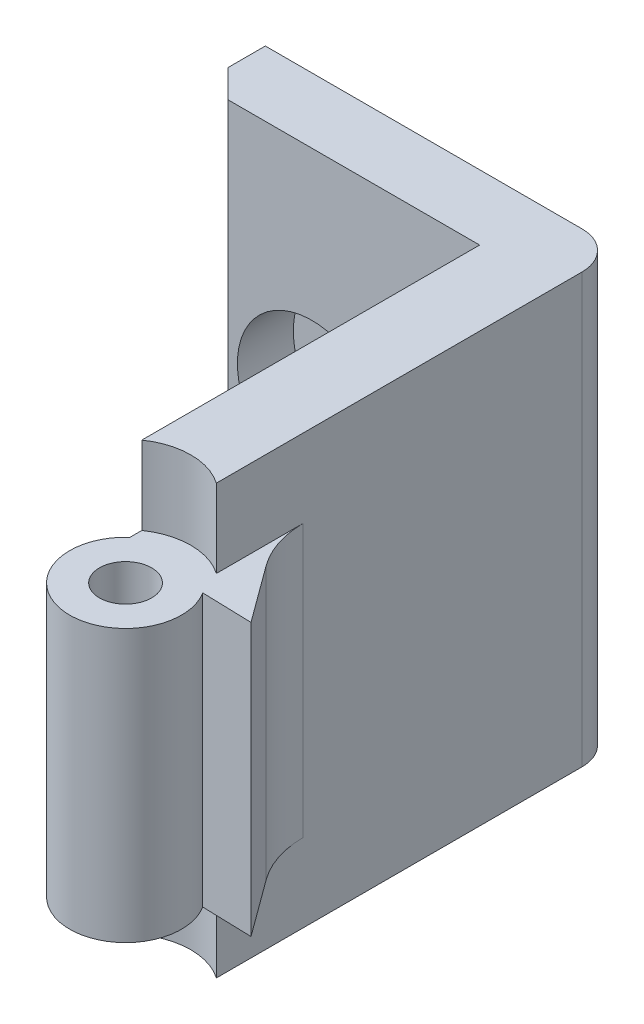
ISO-10303-21;
HEADER;
FILE_DESCRIPTION(('STEP AP214'),'2;1');
FILE_NAME('part.step','',(''),(''),'','','');
FILE_SCHEMA(('AUTOMOTIVE_DESIGN { 1 0 10303 214 1 1 1 1 }'));
ENDSEC;
DATA;
#1=APPLICATION_CONTEXT('core data for automotive mechanical design processes');
#2=APPLICATION_PROTOCOL_DEFINITION('international standard','automotive_design',2000,#1);
#3=PRODUCT_CONTEXT('',#1,'mechanical');
#4=PRODUCT('Part','Part','',(#3));
#5=PRODUCT_RELATED_PRODUCT_CATEGORY('part','',(#4));
#6=PRODUCT_DEFINITION_FORMATION('','',#4);
#7=PRODUCT_DEFINITION_CONTEXT('part definition',#1,'design');
#8=PRODUCT_DEFINITION('design','',#6,#7);
#9=PRODUCT_DEFINITION_SHAPE('','',#8);
#10=(LENGTH_UNIT() NAMED_UNIT(*) SI_UNIT(.MILLI.,.METRE.));
#11=(NAMED_UNIT(*) PLANE_ANGLE_UNIT() SI_UNIT($,.RADIAN.));
#12=(NAMED_UNIT(*) SI_UNIT($,.STERADIAN.) SOLID_ANGLE_UNIT());
#13=UNCERTAINTY_MEASURE_WITH_UNIT(LENGTH_MEASURE(1.E-05),#10,'distance_accuracy_value','');
#14=(GEOMETRIC_REPRESENTATION_CONTEXT(3) GLOBAL_UNCERTAINTY_ASSIGNED_CONTEXT((#13)) GLOBAL_UNIT_ASSIGNED_CONTEXT((#10,
#11,#12)) REPRESENTATION_CONTEXT('',''));
#15=CARTESIAN_POINT('',(0.,0.,0.));
#16=DIRECTION('',(0.,0.,1.));
#17=DIRECTION('',(1.,0.,0.));
#18=AXIS2_PLACEMENT_3D('',#15,#16,#17);
#19=CARTESIAN_POINT('',(-2.71323529411764,31.4852813742386,9.26470588235293));
#20=DIRECTION('',(0.,-1.,0.));
#21=DIRECTION('',(0.,0.,-1.));
#22=AXIS2_PLACEMENT_3D('',#19,#20,#21);
#23=CYLINDRICAL_SURFACE('',#22,3.);
#24=DIRECTION('',(0.,-1.,0.));
#25=VECTOR('',#24,1.);
#26=CARTESIAN_POINT('',(-0.179103081379327,31.4852813742386,7.65903657382081));
#27=LINE('',#26,#25);
#28=CARTESIAN_POINT('',(-0.179103081379326,18.8,7.65903657382081));
#29=VERTEX_POINT('',#28);
#30=CARTESIAN_POINT('',(-0.179103081379326,4.2,7.65903657382081));
#31=VERTEX_POINT('',#30);
#32=EDGE_CURVE('E150',#29,#31,#27,.T.);
#33=ORIENTED_EDGE('',*,*,#32,.F.);
#34=CARTESIAN_POINT('',(-2.71323529411764,18.8,9.26470588235293));
#35=DIRECTION('',(0.,1.,0.));
#36=DIRECTION('',(0.,0.,1.));
#37=AXIS2_PLACEMENT_3D('',#34,#35,#36);
#38=CIRCLE('',#37,3.);
#39=CARTESIAN_POINT('',(-4.71323529411765,18.8,7.02863790485314));
#40=VERTEX_POINT('',#39);
#41=EDGE_CURVE('E185',#29,#40,#38,.F.);
#42=ORIENTED_EDGE('',*,*,#41,.T.);
#43=DIRECTION('',(0.,-1.,0.));
#44=VECTOR('',#43,1.);
#45=CARTESIAN_POINT('',(-4.71323529411765,31.4852813742386,7.02863790485314));
#46=LINE('',#45,#44);
#47=CARTESIAN_POINT('',(-4.71323529411765,4.2,7.02863790485314));
#48=VERTEX_POINT('',#47);
#49=EDGE_CURVE('E209',#48,#40,#46,.F.);
#50=ORIENTED_EDGE('',*,*,#49,.F.);
#51=CARTESIAN_POINT('',(-2.71323529411764,4.2,9.26470588235293));
#52=DIRECTION('',(0.,-1.,0.));
#53=DIRECTION('',(0.,0.,-1.));
#54=AXIS2_PLACEMENT_3D('',#51,#52,#53);
#55=CIRCLE('',#54,3.);
#56=EDGE_CURVE('E199',#48,#31,#55,.F.);
#57=ORIENTED_EDGE('',*,*,#56,.T.);
#58=EDGE_LOOP('',(#33,#42,#50,#57));
#59=FACE_BOUND('',#58,.T.);
#60=ADVANCED_FACE('F35',(#59),#23,.T.);
#61=CARTESIAN_POINT('',(-2.71323529411764,23.,9.26470588235293));
#62=DIRECTION('',(0.,-1.,0.));
#63=DIRECTION('',(0.,0.,-1.));
#64=AXIS2_PLACEMENT_3D('',#61,#62,#63);
#65=CYLINDRICAL_SURFACE('',#64,1.4);
#66=CARTESIAN_POINT('',(-2.71323529411764,4.2,9.26470588235293));
#67=DIRECTION('',(0.,-1.,0.));
#68=DIRECTION('',(0.,0.,-1.));
#69=AXIS2_PLACEMENT_3D('',#66,#67,#68);
#70=CIRCLE('',#69,1.4);
#71=CARTESIAN_POINT('',(-2.71323529411764,4.2,7.86470588235293));
#72=VERTEX_POINT('',#71);
#73=EDGE_CURVE('E196',#72,#72,#70,.F.);
#74=ORIENTED_EDGE('',*,*,#73,.F.);
#75=EDGE_LOOP('',(#74));
#76=FACE_BOUND('',#75,.T.);
#77=CARTESIAN_POINT('',(-2.71323529411764,18.8,9.26470588235293));
#78=DIRECTION('',(0.,1.,0.));
#79=DIRECTION('',(0.,0.,1.));
#80=AXIS2_PLACEMENT_3D('',#77,#78,#79);
#81=CIRCLE('',#80,1.4);
#82=CARTESIAN_POINT('',(-2.71323529411764,18.8,10.6647058823529));
#83=VERTEX_POINT('',#82);
#84=EDGE_CURVE('E190',#83,#83,#81,.F.);
#85=ORIENTED_EDGE('',*,*,#84,.F.);
#86=EDGE_LOOP('',(#85));
#87=FACE_BOUND('',#86,.T.);
#88=ADVANCED_FACE('F323',(#76,#87),#65,.F.);
#89=CARTESIAN_POINT('',(0.,23.,-11.7352941176471));
#90=DIRECTION('',(0.,0.,-1.));
#91=DIRECTION('',(-1.,0.,0.));
#92=AXIS2_PLACEMENT_3D('',#89,#90,#91);
#93=PLANE('',#92);
#94=CARTESIAN_POINT('',(-13.7132352941176,11.,-11.7352941176471));
#95=DIRECTION('',(0.,0.,1.));
#96=DIRECTION('',(1.,0.,0.));
#97=AXIS2_PLACEMENT_3D('',#94,#95,#96);
#98=CIRCLE('',#97,4.);
#99=CARTESIAN_POINT('',(-9.71323529411764,11.,-11.7352941176471));
#100=VERTEX_POINT('',#99);
#101=EDGE_CURVE('E169',#100,#100,#98,.T.);
#102=ORIENTED_EDGE('',*,*,#101,.F.);
#103=EDGE_LOOP('',(#102));
#104=FACE_BOUND('',#103,.T.);
#105=DIRECTION('',(1.,0.,0.));
#106=VECTOR('',#105,1.);
#107=CARTESIAN_POINT('',(0.,23.,-11.7352941176471));
#108=LINE('',#107,#106);
#109=CARTESIAN_POINT('',(-18.2132352941176,23.,-11.7352941176471));
#110=VERTEX_POINT('',#109);
#111=CARTESIAN_POINT('',(-4.71323529411765,23.,-11.7352941176471));
#112=VERTEX_POINT('',#111);
#113=EDGE_CURVE('E213',#110,#112,#108,.T.);
#114=ORIENTED_EDGE('',*,*,#113,.F.);
#115=DIRECTION('',(0.,-1.,0.));
#116=VECTOR('',#115,1.);
#117=CARTESIAN_POINT('',(-18.2132352941176,23.,-11.7352941176471));
#118=LINE('',#117,#116);
#119=CARTESIAN_POINT('',(-18.2132352941176,0.,-11.7352941176471));
#120=VERTEX_POINT('',#119);
#121=EDGE_CURVE('E243',#110,#120,#118,.T.);
#122=ORIENTED_EDGE('',*,*,#121,.T.);
#123=DIRECTION('',(1.,0.,0.));
#124=VECTOR('',#123,1.);
#125=CARTESIAN_POINT('',(0.,0.,-11.7352941176471));
#126=LINE('',#125,#124);
#127=CARTESIAN_POINT('',(-4.71323529411765,0.,-11.7352941176471));
#128=VERTEX_POINT('',#127);
#129=EDGE_CURVE('E212',#120,#128,#126,.T.);
#130=ORIENTED_EDGE('',*,*,#129,.T.);
#131=DIRECTION('',(0.,-1.,0.));
#132=VECTOR('',#131,1.);
#133=CARTESIAN_POINT('',(-4.71323529411765,23.,-11.7352941176471));
#134=LINE('',#133,#132);
#135=EDGE_CURVE('E240',#112,#128,#134,.T.);
#136=ORIENTED_EDGE('',*,*,#135,.F.);
#137=EDGE_LOOP('',(#114,#122,#130,#136));
#138=FACE_BOUND('',#137,.T.);
#139=ADVANCED_FACE('F291',(#104,#138),#93,.F.);
#140=CARTESIAN_POINT('',(-4.71323529411765,23.,0.));
#141=DIRECTION('',(1.,0.,0.));
#142=DIRECTION('',(0.,0.,-1.));
#143=AXIS2_PLACEMENT_3D('',#140,#141,#142);
#144=PLANE('',#143);
#145=DIRECTION('',(0.,0.,1.));
#146=VECTOR('',#145,1.);
#147=CARTESIAN_POINT('',(-4.71323529411765,18.8,0.));
#148=LINE('',#147,#146);
#149=CARTESIAN_POINT('',(-4.71323529411765,18.8,6.39242455908392));
#150=VERTEX_POINT('',#149);
#151=EDGE_CURVE('E187',#150,#40,#148,.T.);
#152=ORIENTED_EDGE('',*,*,#151,.F.);
#153=DIRECTION('',(0.,1.,0.));
#154=VECTOR('',#153,1.);
#155=CARTESIAN_POINT('',(-4.71323529411765,18.8,6.39242455908392));
#156=LINE('',#155,#154);
#157=CARTESIAN_POINT('',(-4.71323529411765,23.,6.39242455908392));
#158=VERTEX_POINT('',#157);
#159=EDGE_CURVE('E182',#150,#158,#156,.T.);
#160=ORIENTED_EDGE('',*,*,#159,.T.);
#161=DIRECTION('',(0.,0.,1.));
#162=VECTOR('',#161,1.);
#163=CARTESIAN_POINT('',(-4.71323529411765,23.,0.));
#164=LINE('',#163,#162);
#165=EDGE_CURVE('E215',#112,#158,#164,.T.);
#166=ORIENTED_EDGE('',*,*,#165,.F.);
#167=ORIENTED_EDGE('',*,*,#135,.T.);
#168=DIRECTION('',(0.,0.,1.));
#169=VECTOR('',#168,1.);
#170=CARTESIAN_POINT('',(-4.71323529411765,0.,0.));
#171=LINE('',#170,#169);
#172=CARTESIAN_POINT('',(-4.71323529411765,0.,6.39242455908392));
#173=VERTEX_POINT('',#172);
#174=EDGE_CURVE('E229',#128,#173,#171,.T.);
#175=ORIENTED_EDGE('',*,*,#174,.T.);
#176=DIRECTION('',(0.,-1.,0.));
#177=VECTOR('',#176,1.);
#178=CARTESIAN_POINT('',(-4.71323529411765,4.2,6.39242455908392));
#179=LINE('',#178,#177);
#180=CARTESIAN_POINT('',(-4.71323529411765,4.2,6.39242455908392));
#181=VERTEX_POINT('',#180);
#182=EDGE_CURVE('E206',#173,#181,#179,.F.);
#183=ORIENTED_EDGE('',*,*,#182,.T.);
#184=DIRECTION('',(0.,0.,-1.));
#185=VECTOR('',#184,1.);
#186=CARTESIAN_POINT('',(-4.71323529411765,4.2,0.));
#187=LINE('',#186,#185);
#188=EDGE_CURVE('E201',#48,#181,#187,.T.);
#189=ORIENTED_EDGE('',*,*,#188,.F.);
#190=ORIENTED_EDGE('',*,*,#49,.T.);
#191=EDGE_LOOP('',(#152,#160,#166,#167,#175,#183,#189,#190));
#192=FACE_BOUND('',#191,.T.);
#193=ADVANCED_FACE('F285',(#192),#144,.F.);
#194=CARTESIAN_POINT('',(-0.713235294117643,23.,0.));
#195=DIRECTION('',(1.,0.,0.));
#196=DIRECTION('',(0.,0.,-1.));
#197=AXIS2_PLACEMENT_3D('',#194,#195,#196);
#198=PLANE('',#197);
#199=DIRECTION('',(0.,0.,1.));
#200=VECTOR('',#199,1.);
#201=CARTESIAN_POINT('',(-0.713235294117643,18.8,0.));
#202=LINE('',#201,#200);
#203=CARTESIAN_POINT('',(-0.713235294117642,18.8,1.73031096763127));
#204=VERTEX_POINT('',#203);
#205=CARTESIAN_POINT('',(-0.713235294117641,18.8,6.39242455908392));
#206=VERTEX_POINT('',#205);
#207=EDGE_CURVE('E50',#204,#206,#202,.T.);
#208=ORIENTED_EDGE('',*,*,#207,.F.);
#209=DIRECTION('',(0.,1.,0.));
#210=VECTOR('',#209,1.);
#211=CARTESIAN_POINT('',(-0.713235294117642,4.2,1.73031096763127));
#212=LINE('',#211,#210);
#213=CARTESIAN_POINT('',(-0.713235294117642,4.2,1.73031096763127));
#214=VERTEX_POINT('',#213);
#215=EDGE_CURVE('E265',#204,#214,#212,.F.);
#216=ORIENTED_EDGE('',*,*,#215,.T.);
#217=DIRECTION('',(0.,0.,-1.));
#218=VECTOR('',#217,1.);
#219=CARTESIAN_POINT('',(-0.713235294117643,4.2,0.));
#220=LINE('',#219,#218);
#221=CARTESIAN_POINT('',(-0.713235294117641,4.2,6.39242455908392));
#222=VERTEX_POINT('',#221);
#223=EDGE_CURVE('E57',#222,#214,#220,.T.);
#224=ORIENTED_EDGE('',*,*,#223,.F.);
#225=DIRECTION('',(0.,-1.,0.));
#226=VECTOR('',#225,1.);
#227=CARTESIAN_POINT('',(-0.713235294117641,4.2,6.39242455908392));
#228=LINE('',#227,#226);
#229=CARTESIAN_POINT('',(-0.71323529411764,0.,6.39242455908392));
#230=VERTEX_POINT('',#229);
#231=EDGE_CURVE('E203',#230,#222,#228,.F.);
#232=ORIENTED_EDGE('',*,*,#231,.F.);
#233=DIRECTION('',(0.,0.,1.));
#234=VECTOR('',#233,1.);
#235=CARTESIAN_POINT('',(-0.713235294117643,0.,0.));
#236=LINE('',#235,#234);
#237=CARTESIAN_POINT('',(-0.713235294117646,0.,-13.2352941176471));
#238=VERTEX_POINT('',#237);
#239=EDGE_CURVE('E232',#238,#230,#236,.T.);
#240=ORIENTED_EDGE('',*,*,#239,.F.);
#241=DIRECTION('',(0.,-1.,0.));
#242=VECTOR('',#241,1.);
#243=CARTESIAN_POINT('',(-0.713235294117646,23.,-13.2352941176471));
#244=LINE('',#243,#242);
#245=CARTESIAN_POINT('',(-0.713235294117646,23.,-13.2352941176471));
#246=VERTEX_POINT('',#245);
#247=EDGE_CURVE('E259',#238,#246,#244,.F.);
#248=ORIENTED_EDGE('',*,*,#247,.T.);
#249=DIRECTION('',(0.,0.,1.));
#250=VECTOR('',#249,1.);
#251=CARTESIAN_POINT('',(-0.713235294117643,23.,0.));
#252=LINE('',#251,#250);
#253=CARTESIAN_POINT('',(-0.713235294117641,23.,6.39242455908392));
#254=VERTEX_POINT('',#253);
#255=EDGE_CURVE('E219',#246,#254,#252,.T.);
#256=ORIENTED_EDGE('',*,*,#255,.T.);
#257=DIRECTION('',(0.,1.,0.));
#258=VECTOR('',#257,1.);
#259=CARTESIAN_POINT('',(-0.713235294117641,18.8,6.39242455908392));
#260=LINE('',#259,#258);
#261=EDGE_CURVE('E178',#206,#254,#260,.T.);
#262=ORIENTED_EDGE('',*,*,#261,.F.);
#263=EDGE_LOOP('',(#208,#216,#224,#232,#240,#248,#256,#262));
#264=FACE_BOUND('',#263,.T.);
#265=ADVANCED_FACE('F272',(#264),#198,.T.);
#266=CARTESIAN_POINT('',(0.,23.,-15.2352941176471));
#267=DIRECTION('',(0.,0.,-1.));
#268=DIRECTION('',(-1.,0.,0.));
#269=AXIS2_PLACEMENT_3D('',#266,#267,#268);
#270=PLANE('',#269);
#271=DIRECTION('',(1.,0.,0.));
#272=VECTOR('',#271,1.);
#273=CARTESIAN_POINT('',(0.,23.,-15.2352941176471));
#274=LINE('',#273,#272);
#275=CARTESIAN_POINT('',(-19.7132352941176,23.,-15.2352941176471));
#276=VERTEX_POINT('',#275);
#277=CARTESIAN_POINT('',(-2.71323529411765,23.,-15.2352941176471));
#278=VERTEX_POINT('',#277);
#279=EDGE_CURVE('E221',#276,#278,#274,.T.);
#280=ORIENTED_EDGE('',*,*,#279,.T.);
#281=DIRECTION('',(0.,-1.,0.));
#282=VECTOR('',#281,1.);
#283=CARTESIAN_POINT('',(-2.71323529411765,23.,-15.2352941176471));
#284=LINE('',#283,#282);
#285=CARTESIAN_POINT('',(-2.71323529411765,0.,-15.2352941176471));
#286=VERTEX_POINT('',#285);
#287=EDGE_CURVE('E254',#278,#286,#284,.T.);
#288=ORIENTED_EDGE('',*,*,#287,.T.);
#289=DIRECTION('',(1.,0.,0.));
#290=VECTOR('',#289,1.);
#291=CARTESIAN_POINT('',(0.,0.,-15.2352941176471));
#292=LINE('',#291,#290);
#293=CARTESIAN_POINT('',(-19.7132352941176,0.,-15.2352941176471));
#294=VERTEX_POINT('',#293);
#295=EDGE_CURVE('E234',#294,#286,#292,.T.);
#296=ORIENTED_EDGE('',*,*,#295,.F.);
#297=DIRECTION('',(0.,-1.,0.));
#298=VECTOR('',#297,1.);
#299=CARTESIAN_POINT('',(-19.7132352941176,23.,-15.2352941176471));
#300=LINE('',#299,#298);
#301=EDGE_CURVE('E227',#276,#294,#300,.T.);
#302=ORIENTED_EDGE('',*,*,#301,.F.);
#303=EDGE_LOOP('',(#280,#288,#296,#302));
#304=FACE_BOUND('',#303,.T.);
#305=ADVANCED_FACE('F309',(#304),#270,.T.);
#306=CARTESIAN_POINT('',(-19.7132352941176,23.,0.));
#307=DIRECTION('',(1.,0.,0.));
#308=DIRECTION('',(0.,0.,-1.));
#309=AXIS2_PLACEMENT_3D('',#306,#307,#308);
#310=PLANE('',#309);
#311=DIRECTION('',(0.,0.,1.));
#312=VECTOR('',#311,1.);
#313=CARTESIAN_POINT('',(-19.7132352941176,0.,0.));
#314=LINE('',#313,#312);
#315=CARTESIAN_POINT('',(-19.7132352941176,0.,-13.2352941176471));
#316=VERTEX_POINT('',#315);
#317=EDGE_CURVE('E216',#294,#316,#314,.T.);
#318=ORIENTED_EDGE('',*,*,#317,.T.);
#319=DIRECTION('',(0.,1.,0.));
#320=VECTOR('',#319,1.);
#321=CARTESIAN_POINT('',(-19.7132352941176,23.,-13.2352941176471));
#322=LINE('',#321,#320);
#323=CARTESIAN_POINT('',(-19.7132352941176,23.,-13.2352941176471));
#324=VERTEX_POINT('',#323);
#325=EDGE_CURVE('E250',#316,#324,#322,.T.);
#326=ORIENTED_EDGE('',*,*,#325,.T.);
#327=DIRECTION('',(0.,0.,1.));
#328=VECTOR('',#327,1.);
#329=CARTESIAN_POINT('',(-19.7132352941176,23.,0.));
#330=LINE('',#329,#328);
#331=EDGE_CURVE('E224',#276,#324,#330,.T.);
#332=ORIENTED_EDGE('',*,*,#331,.F.);
#333=ORIENTED_EDGE('',*,*,#301,.T.);
#334=EDGE_LOOP('',(#318,#326,#332,#333));
#335=FACE_BOUND('',#334,.T.);
#336=ADVANCED_FACE('F298',(#335),#310,.F.);
#337=CARTESIAN_POINT('',(0.,23.,0.));
#338=DIRECTION('',(0.,1.,0.));
#339=DIRECTION('',(0.,0.,1.));
#340=AXIS2_PLACEMENT_3D('',#337,#338,#339);
#341=PLANE('',#340);
#342=ORIENTED_EDGE('',*,*,#255,.F.);
#343=CARTESIAN_POINT('',(-2.71323529411765,23.,-13.2352941176471));
#344=DIRECTION('',(0.,1.,0.));
#345=DIRECTION('',(0.,0.,1.));
#346=AXIS2_PLACEMENT_3D('',#343,#344,#345);
#347=CIRCLE('',#346,2.);
#348=EDGE_CURVE('E261',#246,#278,#347,.T.);
#349=ORIENTED_EDGE('',*,*,#348,.T.);
#350=ORIENTED_EDGE('',*,*,#279,.F.);
#351=ORIENTED_EDGE('',*,*,#331,.T.);
#352=DIRECTION('',(-0.707106781186545,0.,-0.70710678118655));
#353=VECTOR('',#352,1.);
#354=CARTESIAN_POINT('',(-3.23897058823535,23.,3.23897058823533));
#355=LINE('',#354,#353);
#356=EDGE_CURVE('E252',#324,#110,#355,.F.);
#357=ORIENTED_EDGE('',*,*,#356,.T.);
#358=ORIENTED_EDGE('',*,*,#113,.T.);
#359=ORIENTED_EDGE('',*,*,#165,.T.);
#360=CARTESIAN_POINT('',(-2.71323529411764,23.,9.26470588235293));
#361=DIRECTION('',(0.,1.,0.));
#362=DIRECTION('',(0.,0.,1.));
#363=AXIS2_PLACEMENT_3D('',#360,#361,#362);
#364=CIRCLE('',#363,3.5);
#365=EDGE_CURVE('E173',#254,#158,#364,.T.);
#366=ORIENTED_EDGE('',*,*,#365,.F.);
#367=EDGE_LOOP('',(#342,#349,#350,#351,#357,#358,#359,#366));
#368=FACE_BOUND('',#367,.T.);
#369=ADVANCED_FACE('F304',(#368),#341,.T.);
#370=CARTESIAN_POINT('',(0.,0.,0.));
#371=DIRECTION('',(0.,1.,0.));
#372=DIRECTION('',(0.,0.,1.));
#373=AXIS2_PLACEMENT_3D('',#370,#371,#372);
#374=PLANE('',#373);
#375=ORIENTED_EDGE('',*,*,#295,.T.);
#376=CARTESIAN_POINT('',(-2.71323529411765,0.,-13.2352941176471));
#377=DIRECTION('',(0.,1.,0.));
#378=DIRECTION('',(0.,0.,1.));
#379=AXIS2_PLACEMENT_3D('',#376,#377,#378);
#380=CIRCLE('',#379,2.);
#381=EDGE_CURVE('E257',#286,#238,#380,.F.);
#382=ORIENTED_EDGE('',*,*,#381,.T.);
#383=ORIENTED_EDGE('',*,*,#239,.T.);
#384=CARTESIAN_POINT('',(-2.71323529411764,0.,9.26470588235293));
#385=DIRECTION('',(0.,-1.,0.));
#386=DIRECTION('',(0.,0.,-1.));
#387=AXIS2_PLACEMENT_3D('',#384,#385,#386);
#388=CIRCLE('',#387,3.5);
#389=EDGE_CURVE('E193',#173,#230,#388,.T.);
#390=ORIENTED_EDGE('',*,*,#389,.F.);
#391=ORIENTED_EDGE('',*,*,#174,.F.);
#392=ORIENTED_EDGE('',*,*,#129,.F.);
#393=DIRECTION('',(0.707106781186545,0.,0.70710678118655));
#394=VECTOR('',#393,1.);
#395=CARTESIAN_POINT('',(-18.2132352941176,0.,-11.7352941176471));
#396=LINE('',#395,#394);
#397=EDGE_CURVE('E248',#120,#316,#396,.F.);
#398=ORIENTED_EDGE('',*,*,#397,.T.);
#399=ORIENTED_EDGE('',*,*,#317,.F.);
#400=EDGE_LOOP('',(#375,#382,#383,#390,#391,#392,#398,#399));
#401=FACE_BOUND('',#400,.T.);
#402=ADVANCED_FACE('F281',(#401),#374,.F.);
#403=CARTESIAN_POINT('',(-2.71323529411764,4.2,9.26470588235293));
#404=DIRECTION('',(0.,-1.,0.));
#405=DIRECTION('',(0.,0.,-1.));
#406=AXIS2_PLACEMENT_3D('',#403,#404,#405);
#407=CYLINDRICAL_SURFACE('',#406,3.5);
#408=ORIENTED_EDGE('',*,*,#389,.T.);
#409=ORIENTED_EDGE('',*,*,#231,.T.);
#410=CARTESIAN_POINT('',(-2.71323529411764,4.2,9.26470588235293));
#411=DIRECTION('',(0.,-1.,0.));
#412=DIRECTION('',(0.,0.,-1.));
#413=AXIS2_PLACEMENT_3D('',#410,#411,#412);
#414=CIRCLE('',#413,3.5);
#415=EDGE_CURVE('E194',#181,#222,#414,.T.);
#416=ORIENTED_EDGE('',*,*,#415,.F.);
#417=ORIENTED_EDGE('',*,*,#182,.F.);
#418=EDGE_LOOP('',(#408,#409,#416,#417));
#419=FACE_BOUND('',#418,.T.);
#420=ADVANCED_FACE('F277',(#419),#407,.F.);
#421=CARTESIAN_POINT('',(-2.71323529411764,4.2,9.26470588235293));
#422=DIRECTION('',(0.,-1.,0.));
#423=DIRECTION('',(0.,0.,-1.));
#424=AXIS2_PLACEMENT_3D('',#421,#422,#423);
#425=PLANE('',#424);
#426=DIRECTION('',(0.999580350059479,0.,0.0289676332303708));
#427=VECTOR('',#426,1.);
#428=CARTESIAN_POINT('',(-0.922343240174101,4.2,7.63749762668088));
#429=LINE('',#428,#427);
#430=CARTESIAN_POINT('',(2.48949351086266,4.2,7.73637195493278));
#431=VERTEX_POINT('',#430);
#432=EDGE_CURVE('E143',#31,#431,#429,.T.);
#433=ORIENTED_EDGE('',*,*,#432,.F.);
#434=ORIENTED_EDGE('',*,*,#56,.F.);
#435=ORIENTED_EDGE('',*,*,#188,.T.);
#436=ORIENTED_EDGE('',*,*,#415,.T.);
#437=ORIENTED_EDGE('',*,*,#223,.T.);
#438=CARTESIAN_POINT('',(4.28676470588236,4.2,1.73031096763127));
#439=DIRECTION('',(0.,-1.,0.));
#440=DIRECTION('',(0.,0.,-1.));
#441=AXIS2_PLACEMENT_3D('',#438,#439,#440);
#442=CIRCLE('',#441,5.);
#443=CARTESIAN_POINT('',(0.253883863515732,4.2,4.68596184540291));
#444=VERTEX_POINT('',#443);
#445=EDGE_CURVE('E11',#214,#444,#442,.F.);
#446=ORIENTED_EDGE('',*,*,#445,.T.);
#447=DIRECTION('',(-0.591130175554328,0.,-0.806576168473325));
#448=VECTOR('',#447,1.);
#449=CARTESIAN_POINT('',(2.48949351086266,4.2,7.73637195493278));
#450=LINE('',#449,#448);
#451=EDGE_CURVE('E154',#431,#444,#450,.T.);
#452=ORIENTED_EDGE('',*,*,#451,.F.);
#453=EDGE_LOOP('',(#433,#434,#435,#436,#437,#446,#452));
#454=FACE_BOUND('',#453,.T.);
#455=ORIENTED_EDGE('',*,*,#73,.T.);
#456=EDGE_LOOP('',(#455));
#457=FACE_BOUND('',#456,.T.);
#458=ADVANCED_FACE('F155',(#454,#457),#425,.T.);
#459=CARTESIAN_POINT('',(-2.71323529411764,18.8,9.26470588235293));
#460=DIRECTION('',(0.,1.,0.));
#461=DIRECTION('',(0.,0.,1.));
#462=AXIS2_PLACEMENT_3D('',#459,#460,#461);
#463=PLANE('',#462);
#464=ORIENTED_EDGE('',*,*,#41,.F.);
#465=DIRECTION('',(0.999580350059479,0.,0.0289676332303708));
#466=VECTOR('',#465,1.);
#467=CARTESIAN_POINT('',(-0.922343240174101,18.8,7.63749762668088));
#468=LINE('',#467,#466);
#469=CARTESIAN_POINT('',(2.48949351086266,18.8,7.73637195493278));
#470=VERTEX_POINT('',#469);
#471=EDGE_CURVE('E318',#29,#470,#468,.T.);
#472=ORIENTED_EDGE('',*,*,#471,.T.);
#473=DIRECTION('',(-0.591130175554328,0.,-0.806576168473325));
#474=VECTOR('',#473,1.);
#475=CARTESIAN_POINT('',(2.48949351086266,18.8,7.73637195493278));
#476=LINE('',#475,#474);
#477=CARTESIAN_POINT('',(0.253883863515732,18.8,4.68596184540291));
#478=VERTEX_POINT('',#477);
#479=EDGE_CURVE('E151',#470,#478,#476,.T.);
#480=ORIENTED_EDGE('',*,*,#479,.T.);
#481=CARTESIAN_POINT('',(4.28676470588236,18.8,1.73031096763127));
#482=DIRECTION('',(0.,1.,0.));
#483=DIRECTION('',(0.,0.,1.));
#484=AXIS2_PLACEMENT_3D('',#481,#482,#483);
#485=CIRCLE('',#484,5.);
#486=EDGE_CURVE('E43',#478,#204,#485,.F.);
#487=ORIENTED_EDGE('',*,*,#486,.T.);
#488=ORIENTED_EDGE('',*,*,#207,.T.);
#489=CARTESIAN_POINT('',(-2.71323529411764,18.8,9.26470588235293));
#490=DIRECTION('',(0.,1.,0.));
#491=DIRECTION('',(0.,0.,1.));
#492=AXIS2_PLACEMENT_3D('',#489,#490,#491);
#493=CIRCLE('',#492,3.5);
#494=EDGE_CURVE('E176',#206,#150,#493,.T.);
#495=ORIENTED_EDGE('',*,*,#494,.T.);
#496=ORIENTED_EDGE('',*,*,#151,.T.);
#497=EDGE_LOOP('',(#464,#472,#480,#487,#488,#495,#496));
#498=FACE_BOUND('',#497,.T.);
#499=ORIENTED_EDGE('',*,*,#84,.T.);
#500=EDGE_LOOP('',(#499));
#501=FACE_BOUND('',#500,.T.);
#502=ADVANCED_FACE('F269',(#498,#501),#463,.T.);
#503=CARTESIAN_POINT('',(-2.71323529411764,18.8,9.26470588235293));
#504=DIRECTION('',(0.,1.,0.));
#505=DIRECTION('',(0.,0.,1.));
#506=AXIS2_PLACEMENT_3D('',#503,#504,#505);
#507=CYLINDRICAL_SURFACE('',#506,3.5);
#508=ORIENTED_EDGE('',*,*,#494,.F.);
#509=ORIENTED_EDGE('',*,*,#261,.T.);
#510=ORIENTED_EDGE('',*,*,#365,.T.);
#511=ORIENTED_EDGE('',*,*,#159,.F.);
#512=EDGE_LOOP('',(#508,#509,#510,#511));
#513=FACE_BOUND('',#512,.T.);
#514=ADVANCED_FACE('F316',(#513),#507,.F.);
#515=CARTESIAN_POINT('',(-13.7132352941176,11.,-14.7352941176471));
#516=DIRECTION('',(0.,0.,1.));
#517=DIRECTION('',(1.,0.,0.));
#518=AXIS2_PLACEMENT_3D('',#515,#516,#517);
#519=CYLINDRICAL_SURFACE('',#518,4.);
#520=CARTESIAN_POINT('',(-13.7132352941176,11.,-14.7352941176471));
#521=DIRECTION('',(0.,0.,1.));
#522=DIRECTION('',(1.,0.,0.));
#523=AXIS2_PLACEMENT_3D('',#520,#521,#522);
#524=CIRCLE('',#523,4.);
#525=CARTESIAN_POINT('',(-9.71323529411764,11.,-14.7352941176471));
#526=VERTEX_POINT('',#525);
#527=EDGE_CURVE('E170',#526,#526,#524,.T.);
#528=ORIENTED_EDGE('',*,*,#527,.F.);
#529=EDGE_LOOP('',(#528));
#530=FACE_BOUND('',#529,.T.);
#531=ORIENTED_EDGE('',*,*,#101,.T.);
#532=EDGE_LOOP('',(#531));
#533=FACE_BOUND('',#532,.T.);
#534=ADVANCED_FACE('F364',(#530,#533),#519,.F.);
#535=CARTESIAN_POINT('',(-13.7132352941176,11.,-14.7352941176471));
#536=DIRECTION('',(0.,0.,1.));
#537=DIRECTION('',(1.,0.,0.));
#538=AXIS2_PLACEMENT_3D('',#535,#536,#537);
#539=PLANE('',#538);
#540=ORIENTED_EDGE('',*,*,#527,.T.);
#541=EDGE_LOOP('',(#540));
#542=FACE_BOUND('',#541,.T.);
#543=ADVANCED_FACE('F350',(#542),#539,.T.);
#544=CARTESIAN_POINT('',(-18.2132352941176,23.,-11.7352941176471));
#545=DIRECTION('',(0.70710678118655,0.,-0.707106781186545));
#546=DIRECTION('',(0.,-1.,0.));
#547=AXIS2_PLACEMENT_3D('',#544,#545,#546);
#548=PLANE('',#547);
#549=ORIENTED_EDGE('',*,*,#356,.F.);
#550=ORIENTED_EDGE('',*,*,#325,.F.);
#551=ORIENTED_EDGE('',*,*,#397,.F.);
#552=ORIENTED_EDGE('',*,*,#121,.F.);
#553=EDGE_LOOP('',(#549,#550,#551,#552));
#554=FACE_BOUND('',#553,.T.);
#555=ADVANCED_FACE('F301',(#554),#548,.F.);
#556=CARTESIAN_POINT('',(-0.922343240174101,-1.57171812932293,7.63749762668088));
#557=DIRECTION('',(-0.0289676332303708,0.,0.999580350059479));
#558=DIRECTION('',(0.999580350059479,0.,0.0289676332303708));
#559=AXIS2_PLACEMENT_3D('',#556,#557,#558);
#560=PLANE('',#559);
#561=ORIENTED_EDGE('',*,*,#471,.F.);
#562=ORIENTED_EDGE('',*,*,#32,.T.);
#563=ORIENTED_EDGE('',*,*,#432,.T.);
#564=DIRECTION('',(0.,1.,0.));
#565=VECTOR('',#564,1.);
#566=CARTESIAN_POINT('',(2.48949351086266,-1.57171812932293,7.73637195493278));
#567=LINE('',#566,#565);
#568=EDGE_CURVE('E148',#431,#470,#567,.T.);
#569=ORIENTED_EDGE('',*,*,#568,.T.);
#570=EDGE_LOOP('',(#561,#562,#563,#569));
#571=FACE_BOUND('',#570,.T.);
#572=ADVANCED_FACE('F146',(#571),#560,.T.);
#573=CARTESIAN_POINT('',(2.48949351086266,-1.57171812932293,7.73637195493278));
#574=DIRECTION('',(0.806576168473325,0.,-0.591130175554328));
#575=DIRECTION('',(-0.591130175554328,0.,-0.806576168473325));
#576=AXIS2_PLACEMENT_3D('',#573,#574,#575);
#577=PLANE('',#576);
#578=ORIENTED_EDGE('',*,*,#451,.T.);
#579=DIRECTION('',(0.,1.,0.));
#580=VECTOR('',#579,1.);
#581=CARTESIAN_POINT('',(0.253883863515733,18.8,4.68596184540291));
#582=LINE('',#581,#580);
#583=EDGE_CURVE('E263',#444,#478,#582,.T.);
#584=ORIENTED_EDGE('',*,*,#583,.T.);
#585=ORIENTED_EDGE('',*,*,#479,.F.);
#586=ORIENTED_EDGE('',*,*,#568,.F.);
#587=EDGE_LOOP('',(#578,#584,#585,#586));
#588=FACE_BOUND('',#587,.T.);
#589=ADVANCED_FACE('F162',(#588),#577,.T.);
#590=CARTESIAN_POINT('',(-2.71323529411765,23.,-13.2352941176471));
#591=DIRECTION('',(0.,-1.,0.));
#592=DIRECTION('',(0.,0.,-1.));
#593=AXIS2_PLACEMENT_3D('',#590,#591,#592);
#594=CYLINDRICAL_SURFACE('',#593,2.);
#595=ORIENTED_EDGE('',*,*,#348,.F.);
#596=ORIENTED_EDGE('',*,*,#247,.F.);
#597=ORIENTED_EDGE('',*,*,#381,.F.);
#598=ORIENTED_EDGE('',*,*,#287,.F.);
#599=EDGE_LOOP('',(#595,#596,#597,#598));
#600=FACE_BOUND('',#599,.T.);
#601=ADVANCED_FACE('F311',(#600),#594,.T.);
#602=CARTESIAN_POINT('',(4.28676470588236,-1.57171812932293,1.73031096763127));
#603=DIRECTION('',(0.,-1.,0.));
#604=DIRECTION('',(0.,0.,-1.));
#605=AXIS2_PLACEMENT_3D('',#602,#603,#604);
#606=CYLINDRICAL_SURFACE('',#605,5.);
#607=ORIENTED_EDGE('',*,*,#445,.F.);
#608=ORIENTED_EDGE('',*,*,#215,.F.);
#609=ORIENTED_EDGE('',*,*,#486,.F.);
#610=ORIENTED_EDGE('',*,*,#583,.F.);
#611=EDGE_LOOP('',(#607,#608,#609,#610));
#612=FACE_BOUND('',#611,.T.);
#613=ADVANCED_FACE('F37',(#612),#606,.F.);
#614=CLOSED_SHELL('',(#60,#88,#139,#193,#265,#305,#336,#369,#402,#420,#458,#502,#514,#534,#543,
#555,#572,#589,#601,#613));
#615=MANIFOLD_SOLID_BREP('B2',#614);
#616=ADVANCED_BREP_SHAPE_REPRESENTATION('',(#18,#615),#14);
#617=SHAPE_DEFINITION_REPRESENTATION(#9,#616);
ENDSEC;
END-ISO-10303-21;
